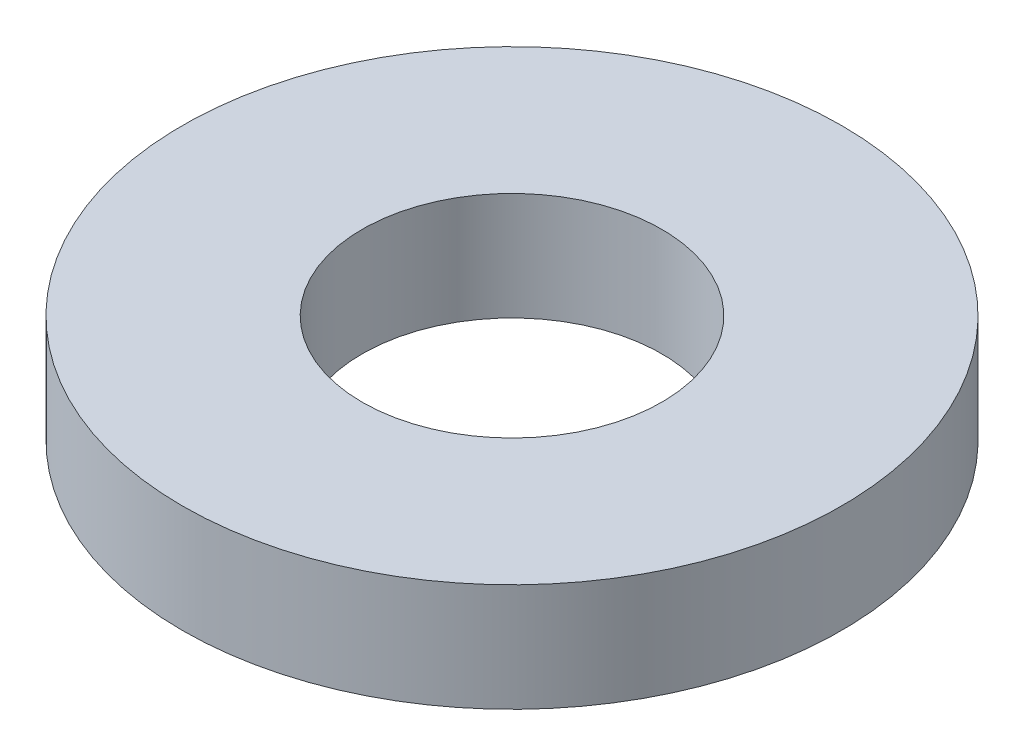
ISO-10303-21;
HEADER;
FILE_DESCRIPTION(('STEP AP214'),'2;1');
FILE_NAME('part.step','',(''),(''),'','','');
FILE_SCHEMA(('AUTOMOTIVE_DESIGN { 1 0 10303 214 1 1 1 1 }'));
ENDSEC;
DATA;
#1=APPLICATION_CONTEXT('core data for automotive mechanical design processes');
#2=APPLICATION_PROTOCOL_DEFINITION('international standard','automotive_design',2000,#1);
#3=PRODUCT_CONTEXT('',#1,'mechanical');
#4=PRODUCT('Part','Part','',(#3));
#5=PRODUCT_RELATED_PRODUCT_CATEGORY('part','',(#4));
#6=PRODUCT_DEFINITION_FORMATION('','',#4);
#7=PRODUCT_DEFINITION_CONTEXT('part definition',#1,'design');
#8=PRODUCT_DEFINITION('design','',#6,#7);
#9=PRODUCT_DEFINITION_SHAPE('','',#8);
#10=(LENGTH_UNIT() NAMED_UNIT(*) SI_UNIT(.MILLI.,.METRE.));
#11=(NAMED_UNIT(*) PLANE_ANGLE_UNIT() SI_UNIT($,.RADIAN.));
#12=(NAMED_UNIT(*) SI_UNIT($,.STERADIAN.) SOLID_ANGLE_UNIT());
#13=UNCERTAINTY_MEASURE_WITH_UNIT(LENGTH_MEASURE(1.E-05),#10,'distance_accuracy_value','');
#14=(GEOMETRIC_REPRESENTATION_CONTEXT(3) GLOBAL_UNCERTAINTY_ASSIGNED_CONTEXT((#13)) GLOBAL_UNIT_ASSIGNED_CONTEXT((#10,
#11,#12)) REPRESENTATION_CONTEXT('',''));
#15=CARTESIAN_POINT('',(0.,0.,0.));
#16=DIRECTION('',(0.,0.,1.));
#17=DIRECTION('',(1.,0.,0.));
#18=AXIS2_PLACEMENT_3D('',#15,#16,#17);
#19=CARTESIAN_POINT('',(0.,27.,0.));
#20=DIRECTION('',(0.,-1.,0.));
#21=DIRECTION('',(0.,0.,-1.));
#22=AXIS2_PLACEMENT_3D('',#19,#20,#21);
#23=CYLINDRICAL_SURFACE('',#22,82.5);
#24=CARTESIAN_POINT('',(0.,27.,0.));
#25=DIRECTION('',(0.,1.,0.));
#26=DIRECTION('',(0.,0.,1.));
#27=AXIS2_PLACEMENT_3D('',#24,#25,#26);
#28=CIRCLE('',#27,82.5);
#29=CARTESIAN_POINT('',(0.,27.,82.5));
#30=VERTEX_POINT('',#29);
#31=EDGE_CURVE('E10',#30,#30,#28,.T.);
#32=ORIENTED_EDGE('',*,*,#31,.F.);
#33=EDGE_LOOP('',(#32));
#34=FACE_BOUND('',#33,.T.);
#35=CARTESIAN_POINT('',(0.,0.,0.));
#36=DIRECTION('',(0.,1.,0.));
#37=DIRECTION('',(0.,0.,1.));
#38=AXIS2_PLACEMENT_3D('',#35,#36,#37);
#39=CIRCLE('',#38,82.5);
#40=CARTESIAN_POINT('',(0.,0.,82.5));
#41=VERTEX_POINT('',#40);
#42=EDGE_CURVE('E37',#41,#41,#39,.T.);
#43=ORIENTED_EDGE('',*,*,#42,.T.);
#44=EDGE_LOOP('',(#43));
#45=FACE_BOUND('',#44,.T.);
#46=ADVANCED_FACE('F40',(#34,#45),#23,.T.);
#47=CARTESIAN_POINT('',(0.,27.,0.));
#48=DIRECTION('',(0.,1.,0.));
#49=DIRECTION('',(0.,0.,1.));
#50=AXIS2_PLACEMENT_3D('',#47,#48,#49);
#51=PLANE('',#50);
#52=CARTESIAN_POINT('',(0.,27.,0.));
#53=DIRECTION('',(0.,1.,0.));
#54=DIRECTION('',(0.,0.,1.));
#55=AXIS2_PLACEMENT_3D('',#52,#53,#54);
#56=CIRCLE('',#55,37.5);
#57=CARTESIAN_POINT('',(0.,27.,37.5));
#58=VERTEX_POINT('',#57);
#59=EDGE_CURVE('E50',#58,#58,#56,.T.);
#60=ORIENTED_EDGE('',*,*,#59,.F.);
#61=EDGE_LOOP('',(#60));
#62=FACE_BOUND('',#61,.T.);
#63=ORIENTED_EDGE('',*,*,#31,.T.);
#64=EDGE_LOOP('',(#63));
#65=FACE_BOUND('',#64,.T.);
#66=ADVANCED_FACE('F59',(#62,#65),#51,.T.);
#67=CARTESIAN_POINT('',(0.,0.,0.));
#68=DIRECTION('',(0.,1.,0.));
#69=DIRECTION('',(0.,0.,1.));
#70=AXIS2_PLACEMENT_3D('',#67,#68,#69);
#71=PLANE('',#70);
#72=CARTESIAN_POINT('',(0.,0.,0.));
#73=DIRECTION('',(0.,1.,0.));
#74=DIRECTION('',(0.,0.,1.));
#75=AXIS2_PLACEMENT_3D('',#72,#73,#74);
#76=CIRCLE('',#75,37.5);
#77=CARTESIAN_POINT('',(0.,0.,37.5));
#78=VERTEX_POINT('',#77);
#79=EDGE_CURVE('E47',#78,#78,#76,.T.);
#80=ORIENTED_EDGE('',*,*,#79,.T.);
#81=EDGE_LOOP('',(#80));
#82=FACE_BOUND('',#81,.T.);
#83=ORIENTED_EDGE('',*,*,#42,.F.);
#84=EDGE_LOOP('',(#83));
#85=FACE_BOUND('',#84,.T.);
#86=ADVANCED_FACE('F58',(#82,#85),#71,.F.);
#87=CARTESIAN_POINT('',(0.,27.,0.));
#88=DIRECTION('',(0.,-1.,0.));
#89=DIRECTION('',(0.,0.,-1.));
#90=AXIS2_PLACEMENT_3D('',#87,#88,#89);
#91=CYLINDRICAL_SURFACE('',#90,37.5);
#92=ORIENTED_EDGE('',*,*,#59,.T.);
#93=EDGE_LOOP('',(#92));
#94=FACE_BOUND('',#93,.T.);
#95=ORIENTED_EDGE('',*,*,#79,.F.);
#96=EDGE_LOOP('',(#95));
#97=FACE_BOUND('',#96,.T.);
#98=ADVANCED_FACE('F54',(#94,#97),#91,.F.);
#99=CLOSED_SHELL('',(#46,#66,#86,#98));
#100=MANIFOLD_SOLID_BREP('B2',#99);
#101=ADVANCED_BREP_SHAPE_REPRESENTATION('',(#18,#100),#14);
#102=SHAPE_DEFINITION_REPRESENTATION(#9,#101);
ENDSEC;
END-ISO-10303-21;
